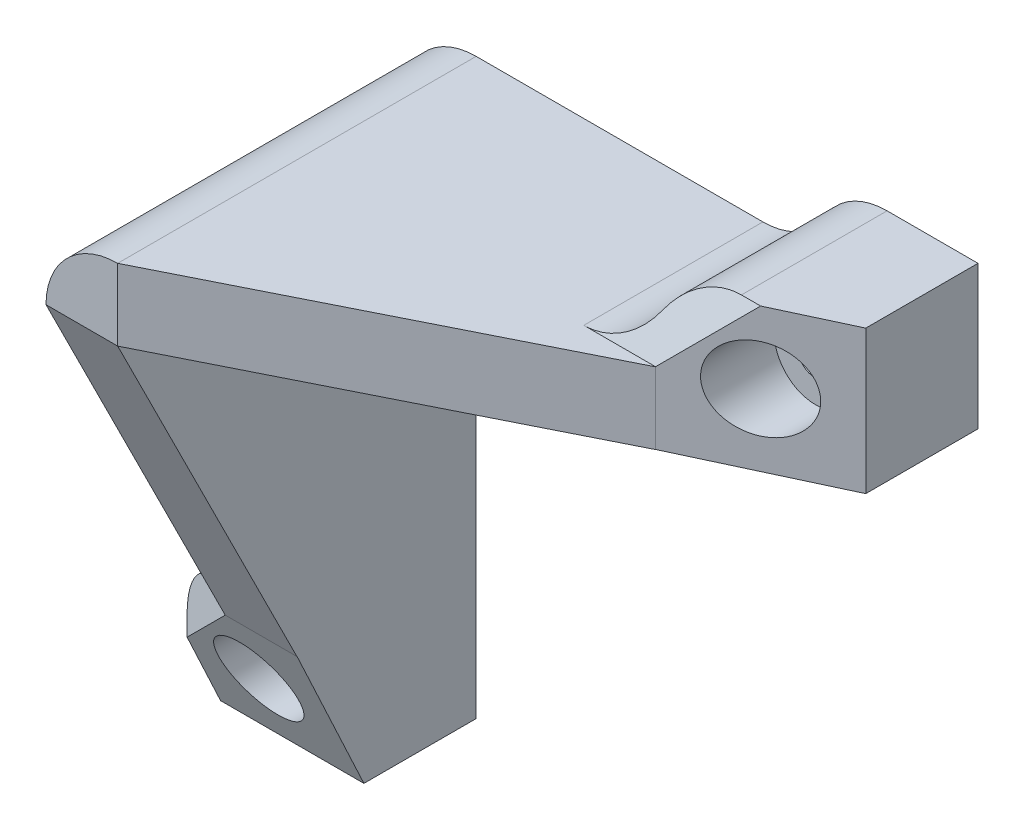
ISO-10303-21;
HEADER;
FILE_DESCRIPTION(('STEP AP214'),'2;1');
FILE_NAME('part.step','',(''),(''),'','','');
FILE_SCHEMA(('AUTOMOTIVE_DESIGN { 1 0 10303 214 1 1 1 1 }'));
ENDSEC;
DATA;
#1=APPLICATION_CONTEXT('core data for automotive mechanical design processes');
#2=APPLICATION_PROTOCOL_DEFINITION('international standard','automotive_design',2000,#1);
#3=PRODUCT_CONTEXT('',#1,'mechanical');
#4=PRODUCT('Part','Part','',(#3));
#5=PRODUCT_RELATED_PRODUCT_CATEGORY('part','',(#4));
#6=PRODUCT_DEFINITION_FORMATION('','',#4);
#7=PRODUCT_DEFINITION_CONTEXT('part definition',#1,'design');
#8=PRODUCT_DEFINITION('design','',#6,#7);
#9=PRODUCT_DEFINITION_SHAPE('','',#8);
#10=(LENGTH_UNIT() NAMED_UNIT(*) SI_UNIT(.MILLI.,.METRE.));
#11=(NAMED_UNIT(*) PLANE_ANGLE_UNIT() SI_UNIT($,.RADIAN.));
#12=(NAMED_UNIT(*) SI_UNIT($,.STERADIAN.) SOLID_ANGLE_UNIT());
#13=UNCERTAINTY_MEASURE_WITH_UNIT(LENGTH_MEASURE(1.E-05),#10,'distance_accuracy_value','');
#14=(GEOMETRIC_REPRESENTATION_CONTEXT(3) GLOBAL_UNCERTAINTY_ASSIGNED_CONTEXT((#13)) GLOBAL_UNIT_ASSIGNED_CONTEXT((#10,
#11,#12)) REPRESENTATION_CONTEXT('',''));
#15=CARTESIAN_POINT('',(0.,0.,0.));
#16=DIRECTION('',(0.,0.,1.));
#17=DIRECTION('',(1.,0.,0.));
#18=AXIS2_PLACEMENT_3D('',#15,#16,#17);
#19=CARTESIAN_POINT('',(57.3205080756888,10.,0.));
#20=DIRECTION('',(0.,0.,1.));
#21=DIRECTION('',(1.,0.,0.));
#22=AXIS2_PLACEMENT_3D('',#19,#20,#21);
#23=PLANE('',#22);
#24=CARTESIAN_POINT('',(60.,10.,0.));
#25=DIRECTION('',(0.,0.,-1.));
#26=DIRECTION('',(-1.,0.,0.));
#27=AXIS2_PLACEMENT_3D('',#24,#25,#26);
#28=CIRCLE('',#27,2.49999999999999);
#29=CARTESIAN_POINT('',(57.5,10.,0.));
#30=VERTEX_POINT('',#29);
#31=EDGE_CURVE('E773',#30,#30,#28,.T.);
#32=ORIENTED_EDGE('',*,*,#31,.F.);
#33=EDGE_LOOP('',(#32));
#34=FACE_BOUND('',#33,.T.);
#35=DIRECTION('',(0.,1.,0.));
#36=VECTOR('',#35,1.);
#37=CARTESIAN_POINT('',(-10.,9.99999999999999,0.));
#38=LINE('',#37,#36);
#39=CARTESIAN_POINT('',(-9.99999999999999,-40.,0.));
#40=VERTEX_POINT('',#39);
#41=CARTESIAN_POINT('',(-10.,0.,0.));
#42=VERTEX_POINT('',#41);
#43=EDGE_CURVE('E722',#40,#42,#38,.T.);
#44=ORIENTED_EDGE('',*,*,#43,.T.);
#45=CARTESIAN_POINT('',(0.,0.,0.));
#46=DIRECTION('',(0.,0.,1.));
#47=DIRECTION('',(1.,0.,0.));
#48=AXIS2_PLACEMENT_3D('',#45,#46,#47);
#49=CIRCLE('',#48,10.);
#50=CARTESIAN_POINT('',(0.,10.,0.));
#51=VERTEX_POINT('',#50);
#52=EDGE_CURVE('E305',#42,#51,#49,.F.);
#53=ORIENTED_EDGE('',*,*,#52,.T.);
#54=DIRECTION('',(1.,0.,0.));
#55=VECTOR('',#54,1.);
#56=CARTESIAN_POINT('',(40.,10.,0.));
#57=LINE('',#56,#55);
#58=CARTESIAN_POINT('',(40.,10.,0.));
#59=VERTEX_POINT('',#58);
#60=EDGE_CURVE('E721',#51,#59,#57,.T.);
#61=ORIENTED_EDGE('',*,*,#60,.T.);
#62=CARTESIAN_POINT('',(40.,20.,0.));
#63=DIRECTION('',(0.,0.,1.));
#64=DIRECTION('',(-1.,0.,0.));
#65=AXIS2_PLACEMENT_3D('',#62,#63,#64);
#66=CIRCLE('',#65,10.);
#67=CARTESIAN_POINT('',(48.6602540378444,15.,0.));
#68=VERTEX_POINT('',#67);
#69=EDGE_CURVE('E140',#59,#68,#66,.T.);
#70=ORIENTED_EDGE('',*,*,#69,.T.);
#71=CARTESIAN_POINT('',(57.3205080756888,10.,0.));
#72=DIRECTION('',(0.,0.,-1.));
#73=DIRECTION('',(1.,0.,0.));
#74=AXIS2_PLACEMENT_3D('',#71,#72,#73);
#75=CIRCLE('',#74,10.);
#76=CARTESIAN_POINT('',(57.3205080756888,20.,0.));
#77=VERTEX_POINT('',#76);
#78=EDGE_CURVE('E136',#68,#77,#75,.T.);
#79=ORIENTED_EDGE('',*,*,#78,.T.);
#80=DIRECTION('',(-1.,0.,0.));
#81=VECTOR('',#80,1.);
#82=CARTESIAN_POINT('',(70.,20.,0.));
#83=LINE('',#82,#81);
#84=CARTESIAN_POINT('',(70.,20.,0.));
#85=VERTEX_POINT('',#84);
#86=EDGE_CURVE('E736',#85,#77,#83,.T.);
#87=ORIENTED_EDGE('',*,*,#86,.F.);
#88=DIRECTION('',(0.,1.,0.));
#89=VECTOR('',#88,1.);
#90=CARTESIAN_POINT('',(70.,20.,0.));
#91=LINE('',#90,#89);
#92=CARTESIAN_POINT('',(70.,0.,0.));
#93=VERTEX_POINT('',#92);
#94=EDGE_CURVE('E744',#93,#85,#91,.T.);
#95=ORIENTED_EDGE('',*,*,#94,.F.);
#96=DIRECTION('',(1.,0.,0.));
#97=VECTOR('',#96,1.);
#98=CARTESIAN_POINT('',(0.,0.,0.));
#99=LINE('',#98,#97);
#100=CARTESIAN_POINT('',(0.,0.,0.));
#101=VERTEX_POINT('',#100);
#102=EDGE_CURVE('E747',#101,#93,#99,.T.);
#103=ORIENTED_EDGE('',*,*,#102,.F.);
#104=DIRECTION('',(0.,-1.,0.));
#105=VECTOR('',#104,1.);
#106=CARTESIAN_POINT('',(0.,-57.3205080756888,0.));
#107=LINE('',#106,#105);
#108=CARTESIAN_POINT('',(0.,-70.,0.));
#109=VERTEX_POINT('',#108);
#110=EDGE_CURVE('E733',#101,#109,#107,.T.);
#111=ORIENTED_EDGE('',*,*,#110,.T.);
#112=DIRECTION('',(1.,0.,0.));
#113=VECTOR('',#112,1.);
#114=CARTESIAN_POINT('',(0.,-70.,0.));
#115=LINE('',#114,#113);
#116=CARTESIAN_POINT('',(-20.,-70.,0.));
#117=VERTEX_POINT('',#116);
#118=EDGE_CURVE('E768',#117,#109,#115,.T.);
#119=ORIENTED_EDGE('',*,*,#118,.F.);
#120=DIRECTION('',(0.,1.,0.));
#121=VECTOR('',#120,1.);
#122=CARTESIAN_POINT('',(-20.,-70.,0.));
#123=LINE('',#122,#121);
#124=CARTESIAN_POINT('',(-20.,-57.3205080756888,0.));
#125=VERTEX_POINT('',#124);
#126=EDGE_CURVE('E765',#117,#125,#123,.T.);
#127=ORIENTED_EDGE('',*,*,#126,.T.);
#128=CARTESIAN_POINT('',(-10.,-57.3205080756888,0.));
#129=DIRECTION('',(0.,0.,-1.));
#130=DIRECTION('',(1.,0.,0.));
#131=AXIS2_PLACEMENT_3D('',#128,#129,#130);
#132=CIRCLE('',#131,10.);
#133=CARTESIAN_POINT('',(-15.,-48.6602540378444,0.));
#134=VERTEX_POINT('',#133);
#135=EDGE_CURVE('E731',#125,#134,#132,.T.);
#136=ORIENTED_EDGE('',*,*,#135,.T.);
#137=CARTESIAN_POINT('',(-20.,-40.,0.));
#138=DIRECTION('',(0.,0.,1.));
#139=DIRECTION('',(-1.,0.,0.));
#140=AXIS2_PLACEMENT_3D('',#137,#138,#139);
#141=CIRCLE('',#140,10.);
#142=EDGE_CURVE('E726',#134,#40,#141,.T.);
#143=ORIENTED_EDGE('',*,*,#142,.T.);
#144=EDGE_LOOP('',(#44,#53,#61,#70,#79,#87,#95,#103,#111,#119,#127,#136,#143));
#145=FACE_BOUND('',#144,.T.);
#146=CARTESIAN_POINT('',(-10.,-60.,0.));
#147=DIRECTION('',(0.,0.,-1.));
#148=DIRECTION('',(-1.,0.,0.));
#149=AXIS2_PLACEMENT_3D('',#146,#147,#148);
#150=CIRCLE('',#149,2.49999999999999);
#151=CARTESIAN_POINT('',(-12.5,-60.,0.));
#152=VERTEX_POINT('',#151);
#153=EDGE_CURVE('E157',#152,#152,#150,.T.);
#154=ORIENTED_EDGE('',*,*,#153,.F.);
#155=EDGE_LOOP('',(#154));
#156=FACE_BOUND('',#155,.T.);
#157=ADVANCED_FACE('F51',(#34,#145,#156),#23,.F.);
#158=CARTESIAN_POINT('',(0.,-57.3205080756888,0.));
#159=DIRECTION('',(-1.,0.,0.));
#160=DIRECTION('',(0.,0.,1.));
#161=AXIS2_PLACEMENT_3D('',#158,#159,#160);
#162=PLANE('',#161);
#163=DIRECTION('',(0.,0.,1.));
#164=VECTOR('',#163,1.);
#165=CARTESIAN_POINT('',(0.,-50.,5.));
#166=LINE('',#165,#164);
#167=CARTESIAN_POINT('',(0.,-50.,24.9812831519421));
#168=VERTEX_POINT('',#167);
#169=CARTESIAN_POINT('',(0.,-50.,25.));
#170=VERTEX_POINT('',#169);
#171=EDGE_CURVE('E757',#168,#170,#166,.T.);
#172=ORIENTED_EDGE('',*,*,#171,.F.);
#173=DIRECTION('',(0.,-0.906307787036647,-0.422618261740705));
#174=VECTOR('',#173,1.);
#175=CARTESIAN_POINT('',(0.,-65.5814065519395,17.7155539519461));
#176=LINE('',#175,#174);
#177=CARTESIAN_POINT('',(0.,-70.,15.655129988842));
#178=VERTEX_POINT('',#177);
#179=EDGE_CURVE('E143',#168,#178,#176,.T.);
#180=ORIENTED_EDGE('',*,*,#179,.T.);
#181=DIRECTION('',(0.,0.,1.));
#182=VECTOR('',#181,1.);
#183=CARTESIAN_POINT('',(0.,-70.,5.));
#184=LINE('',#183,#182);
#185=EDGE_CURVE('E770',#109,#178,#184,.T.);
#186=ORIENTED_EDGE('',*,*,#185,.F.);
#187=ORIENTED_EDGE('',*,*,#110,.F.);
#188=DIRECTION('',(0.,0.,-1.));
#189=VECTOR('',#188,1.);
#190=CARTESIAN_POINT('',(0.,0.,50.));
#191=LINE('',#190,#189);
#192=CARTESIAN_POINT('',(0.,0.,50.));
#193=VERTEX_POINT('',#192);
#194=EDGE_CURVE('E750',#193,#101,#191,.T.);
#195=ORIENTED_EDGE('',*,*,#194,.F.);
#196=DIRECTION('',(0.,-0.894427190999916,-0.447213595499958));
#197=VECTOR('',#196,1.);
#198=CARTESIAN_POINT('',(0.,0.,50.));
#199=LINE('',#198,#197);
#200=EDGE_CURVE('E710',#193,#170,#199,.T.);
#201=ORIENTED_EDGE('',*,*,#200,.T.);
#202=EDGE_LOOP('',(#172,#180,#186,#187,#195,#201));
#203=FACE_BOUND('',#202,.T.);
#204=ADVANCED_FACE('F193',(#203),#162,.F.);
#205=CARTESIAN_POINT('',(-10.,-57.3205080756888,0.));
#206=DIRECTION('',(0.,0.,1.));
#207=DIRECTION('',(1.,0.,0.));
#208=AXIS2_PLACEMENT_3D('',#205,#206,#207);
#209=CYLINDRICAL_SURFACE('',#208,10.);
#210=DIRECTION('',(0.,0.,1.));
#211=VECTOR('',#210,1.);
#212=CARTESIAN_POINT('',(-20.,-57.3205080756888,0.));
#213=LINE('',#212,#211);
#214=CARTESIAN_POINT('',(-20.,-57.3205080756888,20.318206570392));
#215=VERTEX_POINT('',#214);
#216=EDGE_CURVE('E715',#125,#215,#213,.T.);
#217=ORIENTED_EDGE('',*,*,#216,.T.);
#218=CARTESIAN_POINT('',(-10.,-57.3205080756888,24.9812831519421));
#219=DIRECTION('',(0.422618261740705,0.,-0.906307787036647));
#220=DIRECTION('',(0.906307787036647,0.,0.422618261740705));
#221=AXIS2_PLACEMENT_3D('',#218,#219,#220);
#222=ELLIPSE('',#221,11.033779189625,10.);
#223=CARTESIAN_POINT('',(-15.,-48.6602540378444,22.6497448611671));
#224=VERTEX_POINT('',#223);
#225=EDGE_CURVE('E286',#215,#224,#222,.T.);
#226=ORIENTED_EDGE('',*,*,#225,.T.);
#227=DIRECTION('',(0.,0.,1.));
#228=VECTOR('',#227,1.);
#229=CARTESIAN_POINT('',(-15.,-48.6602540378444,0.));
#230=LINE('',#229,#228);
#231=EDGE_CURVE('E713',#134,#224,#230,.T.);
#232=ORIENTED_EDGE('',*,*,#231,.F.);
#233=ORIENTED_EDGE('',*,*,#135,.F.);
#234=EDGE_LOOP('',(#217,#226,#232,#233));
#235=FACE_BOUND('',#234,.T.);
#236=ADVANCED_FACE('F204',(#235),#209,.T.);
#237=CARTESIAN_POINT('',(-20.,-40.,0.));
#238=DIRECTION('',(0.,0.,1.));
#239=DIRECTION('',(1.,0.,0.));
#240=AXIS2_PLACEMENT_3D('',#237,#238,#239);
#241=CYLINDRICAL_SURFACE('',#240,10.);
#242=ORIENTED_EDGE('',*,*,#231,.T.);
#243=CARTESIAN_POINT('',(-20.,-40.,20.318206570392));
#244=DIRECTION('',(0.422618261740705,0.,-0.906307787036647));
#245=DIRECTION('',(0.906307787036647,0.,0.422618261740705));
#246=AXIS2_PLACEMENT_3D('',#243,#244,#245);
#247=ELLIPSE('',#246,11.033779189625,10.);
#248=CARTESIAN_POINT('',(-10.,-40.,24.9812831519421));
#249=VERTEX_POINT('',#248);
#250=EDGE_CURVE('E291',#224,#249,#247,.F.);
#251=ORIENTED_EDGE('',*,*,#250,.T.);
#252=DIRECTION('',(0.,0.,1.));
#253=VECTOR('',#252,1.);
#254=CARTESIAN_POINT('',(-9.99999999999999,-40.,0.));
#255=LINE('',#254,#253);
#256=EDGE_CURVE('E718',#40,#249,#255,.T.);
#257=ORIENTED_EDGE('',*,*,#256,.F.);
#258=ORIENTED_EDGE('',*,*,#142,.F.);
#259=EDGE_LOOP('',(#242,#251,#257,#258));
#260=FACE_BOUND('',#259,.T.);
#261=ADVANCED_FACE('F212',(#260),#241,.F.);
#262=CARTESIAN_POINT('',(70.,0.,0.));
#263=DIRECTION('',(-1.,0.,0.));
#264=DIRECTION('',(0.,0.,1.));
#265=AXIS2_PLACEMENT_3D('',#262,#263,#264);
#266=PLANE('',#265);
#267=DIRECTION('',(0.,0.,1.));
#268=VECTOR('',#267,1.);
#269=CARTESIAN_POINT('',(70.,0.,0.));
#270=LINE('',#269,#268);
#271=CARTESIAN_POINT('',(70.,0.,15.655129988842));
#272=VERTEX_POINT('',#271);
#273=EDGE_CURVE('E80',#93,#272,#270,.T.);
#274=ORIENTED_EDGE('',*,*,#273,.F.);
#275=ORIENTED_EDGE('',*,*,#94,.T.);
#276=DIRECTION('',(0.,0.,1.));
#277=VECTOR('',#276,1.);
#278=CARTESIAN_POINT('',(70.,20.,25.));
#279=LINE('',#278,#277);
#280=CARTESIAN_POINT('',(70.,20.,15.655129988842));
#281=VERTEX_POINT('',#280);
#282=EDGE_CURVE('E67',#85,#281,#279,.T.);
#283=ORIENTED_EDGE('',*,*,#282,.T.);
#284=DIRECTION('',(0.,-1.,0.));
#285=VECTOR('',#284,1.);
#286=CARTESIAN_POINT('',(70.,0.,15.655129988842));
#287=LINE('',#286,#285);
#288=EDGE_CURVE('E153',#281,#272,#287,.T.);
#289=ORIENTED_EDGE('',*,*,#288,.T.);
#290=EDGE_LOOP('',(#274,#275,#283,#289));
#291=FACE_BOUND('',#290,.T.);
#292=ADVANCED_FACE('F218',(#291),#266,.F.);
#293=CARTESIAN_POINT('',(25.,17.,37.5));
#294=DIRECTION('',(-0.447213595499958,0.,-0.894427190999916));
#295=DIRECTION('',(-0.894427190999916,0.,0.447213595499958));
#296=AXIS2_PLACEMENT_3D('',#293,#294,#295);
#297=PLANE('',#296);
#298=DIRECTION('',(-0.894427190999916,0.,0.447213595499958));
#299=VECTOR('',#298,1.);
#300=CARTESIAN_POINT('',(50.,0.,25.));
#301=LINE('',#300,#299);
#302=CARTESIAN_POINT('',(50.,0.,25.));
#303=VERTEX_POINT('',#302);
#304=EDGE_CURVE('E755',#303,#193,#301,.T.);
#305=ORIENTED_EDGE('',*,*,#304,.F.);
#306=DIRECTION('',(0.,-1.,0.));
#307=VECTOR('',#306,1.);
#308=CARTESIAN_POINT('',(50.,5.,25.));
#309=LINE('',#308,#307);
#310=CARTESIAN_POINT('',(50.,10.,25.));
#311=VERTEX_POINT('',#310);
#312=EDGE_CURVE('E321',#303,#311,#309,.F.);
#313=ORIENTED_EDGE('',*,*,#312,.T.);
#314=DIRECTION('',(0.894427190999916,0.,-0.447213595499958));
#315=VECTOR('',#314,1.);
#316=CARTESIAN_POINT('',(50.,10.,25.));
#317=LINE('',#316,#315);
#318=CARTESIAN_POINT('',(0.,10.,50.));
#319=VERTEX_POINT('',#318);
#320=EDGE_CURVE('E703',#319,#311,#317,.T.);
#321=ORIENTED_EDGE('',*,*,#320,.F.);
#322=DIRECTION('',(0.,-1.,0.));
#323=VECTOR('',#322,1.);
#324=CARTESIAN_POINT('',(0.,10.,50.));
#325=LINE('',#324,#323);
#326=EDGE_CURVE('E516',#319,#193,#325,.T.);
#327=ORIENTED_EDGE('',*,*,#326,.T.);
#328=EDGE_LOOP('',(#305,#313,#321,#327));
#329=FACE_BOUND('',#328,.T.);
#330=ADVANCED_FACE('F231',(#329),#297,.F.);
#331=CARTESIAN_POINT('',(70.,20.,25.));
#332=DIRECTION('',(0.,-1.,0.));
#333=DIRECTION('',(0.,0.,-1.));
#334=AXIS2_PLACEMENT_3D('',#331,#332,#333);
#335=PLANE('',#334);
#336=DIRECTION('',(1.,0.,0.));
#337=VECTOR('',#336,1.);
#338=CARTESIAN_POINT('',(70.,20.,20.318206570392));
#339=LINE('',#338,#337);
#340=CARTESIAN_POINT('',(57.3205080756888,20.,20.318206570392));
#341=VERTEX_POINT('',#340);
#342=CARTESIAN_POINT('',(60.,20.,20.318206570392));
#343=VERTEX_POINT('',#342);
#344=EDGE_CURVE('E148',#341,#343,#339,.T.);
#345=ORIENTED_EDGE('',*,*,#344,.T.);
#346=DIRECTION('',(0.906307787036647,0.,-0.422618261740705));
#347=VECTOR('',#346,1.);
#348=CARTESIAN_POINT('',(66.4207071281416,20.,17.3241816657692));
#349=LINE('',#348,#347);
#350=EDGE_CURVE('E13',#343,#281,#349,.T.);
#351=ORIENTED_EDGE('',*,*,#350,.T.);
#352=ORIENTED_EDGE('',*,*,#282,.F.);
#353=ORIENTED_EDGE('',*,*,#86,.T.);
#354=DIRECTION('',(0.,0.,1.));
#355=VECTOR('',#354,1.);
#356=CARTESIAN_POINT('',(57.3205080756888,20.,0.));
#357=LINE('',#356,#355);
#358=EDGE_CURVE('E708',#77,#341,#357,.T.);
#359=ORIENTED_EDGE('',*,*,#358,.T.);
#360=EDGE_LOOP('',(#345,#351,#352,#353,#359));
#361=FACE_BOUND('',#360,.T.);
#362=ADVANCED_FACE('F206',(#361),#335,.F.);
#363=CARTESIAN_POINT('',(57.3205080756888,10.,0.));
#364=DIRECTION('',(0.,0.,1.));
#365=DIRECTION('',(1.,0.,0.));
#366=AXIS2_PLACEMENT_3D('',#363,#364,#365);
#367=CYLINDRICAL_SURFACE('',#366,10.);
#368=DIRECTION('',(0.,0.,1.));
#369=VECTOR('',#368,1.);
#370=CARTESIAN_POINT('',(48.6602540378444,15.,0.));
#371=LINE('',#370,#369);
#372=CARTESIAN_POINT('',(48.6602540378444,15.,22.6497448611671));
#373=VERTEX_POINT('',#372);
#374=EDGE_CURVE('E128',#68,#373,#371,.T.);
#375=ORIENTED_EDGE('',*,*,#374,.T.);
#376=CARTESIAN_POINT('',(57.3205080756888,10.,24.9812831519421));
#377=DIRECTION('',(0.,-0.422618261740705,-0.906307787036647));
#378=DIRECTION('',(0.,-0.906307787036647,0.422618261740705));
#379=AXIS2_PLACEMENT_3D('',#376,#377,#378);
#380=ELLIPSE('',#379,11.033779189625,10.);
#381=EDGE_CURVE('E131',#373,#341,#380,.T.);
#382=ORIENTED_EDGE('',*,*,#381,.T.);
#383=ORIENTED_EDGE('',*,*,#358,.F.);
#384=ORIENTED_EDGE('',*,*,#78,.F.);
#385=EDGE_LOOP('',(#375,#382,#383,#384));
#386=FACE_BOUND('',#385,.T.);
#387=ADVANCED_FACE('F129',(#386),#367,.T.);
#388=CARTESIAN_POINT('',(40.,20.,0.));
#389=DIRECTION('',(0.,0.,1.));
#390=DIRECTION('',(1.,0.,0.));
#391=AXIS2_PLACEMENT_3D('',#388,#389,#390);
#392=CYLINDRICAL_SURFACE('',#391,10.);
#393=DIRECTION('',(0.,0.,1.));
#394=VECTOR('',#393,1.);
#395=CARTESIAN_POINT('',(40.,10.,0.));
#396=LINE('',#395,#394);
#397=CARTESIAN_POINT('',(40.,10.,24.9812831519421));
#398=VERTEX_POINT('',#397);
#399=EDGE_CURVE('E100',#59,#398,#396,.T.);
#400=ORIENTED_EDGE('',*,*,#399,.T.);
#401=CARTESIAN_POINT('',(40.,20.,20.318206570392));
#402=DIRECTION('',(0.,-0.422618261740705,-0.906307787036647));
#403=DIRECTION('',(0.,-0.906307787036647,0.422618261740705));
#404=AXIS2_PLACEMENT_3D('',#401,#402,#403);
#405=ELLIPSE('',#404,11.033779189625,10.);
#406=EDGE_CURVE('E137',#398,#373,#405,.F.);
#407=ORIENTED_EDGE('',*,*,#406,.T.);
#408=ORIENTED_EDGE('',*,*,#374,.F.);
#409=ORIENTED_EDGE('',*,*,#69,.F.);
#410=EDGE_LOOP('',(#400,#407,#408,#409));
#411=FACE_BOUND('',#410,.T.);
#412=ADVANCED_FACE('F142',(#411),#392,.F.);
#413=CARTESIAN_POINT('',(-39.7,-25.,37.5));
#414=DIRECTION('',(0.,0.447213595499958,-0.894427190999916));
#415=DIRECTION('',(0.,0.894427190999916,0.447213595499958));
#416=AXIS2_PLACEMENT_3D('',#413,#414,#415);
#417=PLANE('',#416);
#418=ORIENTED_EDGE('',*,*,#200,.F.);
#419=DIRECTION('',(1.,0.,0.));
#420=VECTOR('',#419,1.);
#421=CARTESIAN_POINT('',(-39.7,0.,50.));
#422=LINE('',#421,#420);
#423=CARTESIAN_POINT('',(-10.,0.,50.));
#424=VERTEX_POINT('',#423);
#425=EDGE_CURVE('E320',#424,#193,#422,.T.);
#426=ORIENTED_EDGE('',*,*,#425,.F.);
#427=DIRECTION('',(0.,0.894427190999916,0.447213595499958));
#428=VECTOR('',#427,1.);
#429=CARTESIAN_POINT('',(-10.,-20.,40.));
#430=LINE('',#429,#428);
#431=CARTESIAN_POINT('',(-10.,-50.,25.));
#432=VERTEX_POINT('',#431);
#433=EDGE_CURVE('E512',#432,#424,#430,.T.);
#434=ORIENTED_EDGE('',*,*,#433,.F.);
#435=DIRECTION('',(1.,0.,0.));
#436=VECTOR('',#435,1.);
#437=CARTESIAN_POINT('',(-39.7,-50.,25.));
#438=LINE('',#437,#436);
#439=EDGE_CURVE('E313',#170,#432,#438,.F.);
#440=ORIENTED_EDGE('',*,*,#439,.F.);
#441=EDGE_LOOP('',(#418,#426,#434,#440));
#442=FACE_BOUND('',#441,.T.);
#443=ADVANCED_FACE('F215',(#442),#417,.F.);
#444=CARTESIAN_POINT('',(-10.,-25.,50.));
#445=DIRECTION('',(1.,0.,0.));
#446=DIRECTION('',(0.,1.,0.));
#447=AXIS2_PLACEMENT_3D('',#444,#445,#446);
#448=PLANE('',#447);
#449=ORIENTED_EDGE('',*,*,#256,.T.);
#450=DIRECTION('',(0.,-1.,0.));
#451=VECTOR('',#450,1.);
#452=CARTESIAN_POINT('',(-10.,-25.,24.9812831519421));
#453=LINE('',#452,#451);
#454=CARTESIAN_POINT('',(-10.,-50.,24.9812831519421));
#455=VERTEX_POINT('',#454);
#456=EDGE_CURVE('E297',#249,#455,#453,.T.);
#457=ORIENTED_EDGE('',*,*,#456,.T.);
#458=DIRECTION('',(0.,0.,1.));
#459=VECTOR('',#458,1.);
#460=CARTESIAN_POINT('',(-10.,-50.,5.));
#461=LINE('',#460,#459);
#462=EDGE_CURVE('E758',#455,#432,#461,.T.);
#463=ORIENTED_EDGE('',*,*,#462,.T.);
#464=ORIENTED_EDGE('',*,*,#433,.T.);
#465=DIRECTION('',(0.,0.,1.));
#466=VECTOR('',#465,1.);
#467=CARTESIAN_POINT('',(-10.,0.,50.));
#468=LINE('',#467,#466);
#469=EDGE_CURVE('E304',#424,#42,#468,.F.);
#470=ORIENTED_EDGE('',*,*,#469,.T.);
#471=ORIENTED_EDGE('',*,*,#43,.F.);
#472=EDGE_LOOP('',(#449,#457,#463,#464,#470,#471));
#473=FACE_BOUND('',#472,.T.);
#474=ADVANCED_FACE('F233',(#473),#448,.F.);
#475=CARTESIAN_POINT('',(0.,10.,50.));
#476=DIRECTION('',(0.,0.,-1.));
#477=DIRECTION('',(-1.,0.,0.));
#478=AXIS2_PLACEMENT_3D('',#475,#476,#477);
#479=PLANE('',#478);
#480=ORIENTED_EDGE('',*,*,#326,.F.);
#481=CARTESIAN_POINT('',(0.,0.,50.));
#482=DIRECTION('',(0.,0.,-1.));
#483=DIRECTION('',(-1.,0.,0.));
#484=AXIS2_PLACEMENT_3D('',#481,#482,#483);
#485=CIRCLE('',#484,10.);
#486=EDGE_CURVE('E308',#319,#424,#485,.F.);
#487=ORIENTED_EDGE('',*,*,#486,.T.);
#488=ORIENTED_EDGE('',*,*,#425,.T.);
#489=EDGE_LOOP('',(#480,#487,#488));
#490=FACE_BOUND('',#489,.T.);
#491=ADVANCED_FACE('F227',(#490),#479,.F.);
#492=CARTESIAN_POINT('',(0.,10.,0.));
#493=DIRECTION('',(0.,-1.,0.));
#494=DIRECTION('',(1.,0.,0.));
#495=AXIS2_PLACEMENT_3D('',#492,#493,#494);
#496=PLANE('',#495);
#497=DIRECTION('',(0.,0.,1.));
#498=VECTOR('',#497,1.);
#499=CARTESIAN_POINT('',(50.,10.,5.));
#500=LINE('',#499,#498);
#501=CARTESIAN_POINT('',(50.,10.,24.9812831519421));
#502=VERTEX_POINT('',#501);
#503=EDGE_CURVE('E743',#502,#311,#500,.T.);
#504=ORIENTED_EDGE('',*,*,#503,.F.);
#505=DIRECTION('',(-1.,0.,0.));
#506=VECTOR('',#505,1.);
#507=CARTESIAN_POINT('',(0.,10.,24.9812831519421));
#508=LINE('',#507,#506);
#509=EDGE_CURVE('E300',#502,#398,#508,.T.);
#510=ORIENTED_EDGE('',*,*,#509,.T.);
#511=ORIENTED_EDGE('',*,*,#399,.F.);
#512=ORIENTED_EDGE('',*,*,#60,.F.);
#513=DIRECTION('',(0.,0.,1.));
#514=VECTOR('',#513,1.);
#515=CARTESIAN_POINT('',(0.,10.,0.));
#516=LINE('',#515,#514);
#517=EDGE_CURVE('E311',#51,#319,#516,.T.);
#518=ORIENTED_EDGE('',*,*,#517,.T.);
#519=ORIENTED_EDGE('',*,*,#320,.T.);
#520=EDGE_LOOP('',(#504,#510,#511,#512,#518,#519));
#521=FACE_BOUND('',#520,.T.);
#522=ADVANCED_FACE('F225',(#521),#496,.F.);
#523=CARTESIAN_POINT('',(50.,10.,5.));
#524=DIRECTION('',(-1.,0.,0.));
#525=DIRECTION('',(0.,0.,1.));
#526=AXIS2_PLACEMENT_3D('',#523,#524,#525);
#527=PLANE('',#526);
#528=DIRECTION('',(0.,0.,1.));
#529=VECTOR('',#528,1.);
#530=CARTESIAN_POINT('',(50.,0.,5.));
#531=LINE('',#530,#529);
#532=CARTESIAN_POINT('',(50.,0.,24.9812831519421));
#533=VERTEX_POINT('',#532);
#534=EDGE_CURVE('E752',#533,#303,#531,.T.);
#535=ORIENTED_EDGE('',*,*,#534,.F.);
#536=DIRECTION('',(0.,1.,0.));
#537=VECTOR('',#536,1.);
#538=CARTESIAN_POINT('',(50.,10.,24.9812831519421));
#539=LINE('',#538,#537);
#540=EDGE_CURVE('E109',#533,#502,#539,.T.);
#541=ORIENTED_EDGE('',*,*,#540,.T.);
#542=ORIENTED_EDGE('',*,*,#503,.T.);
#543=ORIENTED_EDGE('',*,*,#312,.F.);
#544=EDGE_LOOP('',(#535,#541,#542,#543));
#545=FACE_BOUND('',#544,.T.);
#546=ADVANCED_FACE('F228',(#545),#527,.F.);
#547=CARTESIAN_POINT('',(0.,0.,0.));
#548=DIRECTION('',(0.,1.,0.));
#549=DIRECTION('',(0.,0.,1.));
#550=AXIS2_PLACEMENT_3D('',#547,#548,#549);
#551=PLANE('',#550);
#552=ORIENTED_EDGE('',*,*,#273,.T.);
#553=DIRECTION('',(-0.906307787036647,0.,0.422618261740705));
#554=VECTOR('',#553,1.);
#555=CARTESIAN_POINT('',(18.4986963281004,0.,39.6705822960153));
#556=LINE('',#555,#554);
#557=EDGE_CURVE('E61',#272,#533,#556,.T.);
#558=ORIENTED_EDGE('',*,*,#557,.T.);
#559=ORIENTED_EDGE('',*,*,#534,.T.);
#560=ORIENTED_EDGE('',*,*,#304,.T.);
#561=ORIENTED_EDGE('',*,*,#194,.T.);
#562=ORIENTED_EDGE('',*,*,#102,.T.);
#563=EDGE_LOOP('',(#552,#558,#559,#560,#561,#562));
#564=FACE_BOUND('',#563,.T.);
#565=ADVANCED_FACE('F871',(#564),#551,.F.);
#566=CARTESIAN_POINT('',(0.,-50.,5.));
#567=DIRECTION('',(0.,1.,0.));
#568=DIRECTION('',(0.,0.,1.));
#569=AXIS2_PLACEMENT_3D('',#566,#567,#568);
#570=PLANE('',#569);
#571=ORIENTED_EDGE('',*,*,#462,.F.);
#572=DIRECTION('',(1.,0.,0.));
#573=VECTOR('',#572,1.);
#574=CARTESIAN_POINT('',(0.,-50.,24.9812831519421));
#575=LINE('',#574,#573);
#576=EDGE_CURVE('E276',#455,#168,#575,.T.);
#577=ORIENTED_EDGE('',*,*,#576,.T.);
#578=ORIENTED_EDGE('',*,*,#171,.T.);
#579=ORIENTED_EDGE('',*,*,#439,.T.);
#580=EDGE_LOOP('',(#571,#577,#578,#579));
#581=FACE_BOUND('',#580,.T.);
#582=ADVANCED_FACE('F874',(#581),#570,.F.);
#583=CARTESIAN_POINT('',(-20.,-70.,0.));
#584=DIRECTION('',(1.,0.,0.));
#585=DIRECTION('',(0.,0.,-1.));
#586=AXIS2_PLACEMENT_3D('',#583,#584,#585);
#587=PLANE('',#586);
#588=ORIENTED_EDGE('',*,*,#216,.F.);
#589=ORIENTED_EDGE('',*,*,#126,.F.);
#590=DIRECTION('',(0.,0.,-1.));
#591=VECTOR('',#590,1.);
#592=CARTESIAN_POINT('',(-20.,-70.,0.));
#593=LINE('',#592,#591);
#594=CARTESIAN_POINT('',(-20.,-70.,15.655129988842));
#595=VERTEX_POINT('',#594);
#596=EDGE_CURVE('E775',#595,#117,#593,.T.);
#597=ORIENTED_EDGE('',*,*,#596,.F.);
#598=DIRECTION('',(0.,0.906307787036647,0.422618261740705));
#599=VECTOR('',#598,1.);
#600=CARTESIAN_POINT('',(-20.,-75.9962626671289,12.8590267868508));
#601=LINE('',#600,#599);
#602=CARTESIAN_POINT('',(-20.,-60.,20.318206570392));
#603=VERTEX_POINT('',#602);
#604=EDGE_CURVE('E281',#595,#603,#601,.T.);
#605=ORIENTED_EDGE('',*,*,#604,.T.);
#606=DIRECTION('',(0.,1.,0.));
#607=VECTOR('',#606,1.);
#608=CARTESIAN_POINT('',(-20.,-70.,20.318206570392));
#609=LINE('',#608,#607);
#610=EDGE_CURVE('E287',#603,#215,#609,.T.);
#611=ORIENTED_EDGE('',*,*,#610,.T.);
#612=EDGE_LOOP('',(#588,#589,#597,#605,#611));
#613=FACE_BOUND('',#612,.T.);
#614=ADVANCED_FACE('F840',(#613),#587,.F.);
#615=CARTESIAN_POINT('',(0.,-70.,0.));
#616=DIRECTION('',(0.,1.,0.));
#617=DIRECTION('',(0.,0.,1.));
#618=AXIS2_PLACEMENT_3D('',#615,#616,#617);
#619=PLANE('',#618);
#620=ORIENTED_EDGE('',*,*,#596,.T.);
#621=ORIENTED_EDGE('',*,*,#118,.T.);
#622=ORIENTED_EDGE('',*,*,#185,.T.);
#623=DIRECTION('',(-1.,0.,0.));
#624=VECTOR('',#623,1.);
#625=CARTESIAN_POINT('',(0.,-70.,15.655129988842));
#626=LINE('',#625,#624);
#627=EDGE_CURVE('E279',#178,#595,#626,.T.);
#628=ORIENTED_EDGE('',*,*,#627,.T.);
#629=EDGE_LOOP('',(#620,#621,#622,#628));
#630=FACE_BOUND('',#629,.T.);
#631=ADVANCED_FACE('F841',(#630),#619,.F.);
#632=CARTESIAN_POINT('',(60.,10.,0.));
#633=DIRECTION('',(0.,0.,-1.));
#634=DIRECTION('',(-1.,0.,0.));
#635=AXIS2_PLACEMENT_3D('',#632,#633,#634);
#636=CYLINDRICAL_SURFACE('',#635,2.5);
#637=CARTESIAN_POINT('',(60.,10.,12.7));
#638=DIRECTION('',(0.,0.,-1.));
#639=DIRECTION('',(-1.,0.,0.));
#640=AXIS2_PLACEMENT_3D('',#637,#638,#639);
#641=CIRCLE('',#640,2.5);
#642=CARTESIAN_POINT('',(57.5,10.,12.7));
#643=VERTEX_POINT('',#642);
#644=EDGE_CURVE('E57',#643,#643,#641,.F.);
#645=ORIENTED_EDGE('',*,*,#644,.T.);
#646=EDGE_LOOP('',(#645));
#647=FACE_BOUND('',#646,.T.);
#648=ORIENTED_EDGE('',*,*,#31,.T.);
#649=EDGE_LOOP('',(#648));
#650=FACE_BOUND('',#649,.T.);
#651=ADVANCED_FACE('F176',(#647,#650),#636,.F.);
#652=CARTESIAN_POINT('',(-10.,-60.,0.));
#653=DIRECTION('',(0.,0.,-1.));
#654=DIRECTION('',(-1.,0.,0.));
#655=AXIS2_PLACEMENT_3D('',#652,#653,#654);
#656=CYLINDRICAL_SURFACE('',#655,2.49999999999999);
#657=CARTESIAN_POINT('',(-10.,-60.,12.7));
#658=DIRECTION('',(0.,0.,-1.));
#659=DIRECTION('',(-1.,0.,0.));
#660=AXIS2_PLACEMENT_3D('',#657,#658,#659);
#661=CIRCLE('',#660,2.49999999999999);
#662=CARTESIAN_POINT('',(-12.5,-60.,12.7));
#663=VERTEX_POINT('',#662);
#664=EDGE_CURVE('E169',#663,#663,#661,.F.);
#665=ORIENTED_EDGE('',*,*,#664,.T.);
#666=EDGE_LOOP('',(#665));
#667=FACE_BOUND('',#666,.T.);
#668=ORIENTED_EDGE('',*,*,#153,.T.);
#669=EDGE_LOOP('',(#668));
#670=FACE_BOUND('',#669,.T.);
#671=ADVANCED_FACE('F246',(#667,#670),#656,.F.);
#672=CARTESIAN_POINT('',(0.,0.,0.));
#673=DIRECTION('',(0.,0.,1.));
#674=DIRECTION('',(0.,-1.,0.));
#675=AXIS2_PLACEMENT_3D('',#672,#673,#674);
#676=CYLINDRICAL_SURFACE('',#675,10.);
#677=ORIENTED_EDGE('',*,*,#52,.F.);
#678=ORIENTED_EDGE('',*,*,#469,.F.);
#679=ORIENTED_EDGE('',*,*,#486,.F.);
#680=ORIENTED_EDGE('',*,*,#517,.F.);
#681=EDGE_LOOP('',(#677,#678,#679,#680));
#682=FACE_BOUND('',#681,.T.);
#683=ADVANCED_FACE('F245',(#682),#676,.T.);
#684=CARTESIAN_POINT('',(-10.,-92.8500000000002,5.));
#685=DIRECTION('',(0.,0.422618261740705,-0.906307787036647));
#686=DIRECTION('',(-1.,0.,0.));
#687=AXIS2_PLACEMENT_3D('',#684,#685,#686);
#688=PLANE('',#687);
#689=CARTESIAN_POINT('',(-10.,-60.,20.318206570392));
#690=DIRECTION('',(0.,0.422618261740705,-0.906307787036647));
#691=DIRECTION('',(0.,-0.906307787036647,-0.422618261740705));
#692=AXIS2_PLACEMENT_3D('',#689,#690,#691);
#693=ELLIPSE('',#692,6.30580480687066,5.715);
#694=CARTESIAN_POINT('',(-10.,-65.715,17.6532583040362));
#695=VERTEX_POINT('',#694);
#696=EDGE_CURVE('E168',#695,#695,#693,.T.);
#697=ORIENTED_EDGE('',*,*,#696,.T.);
#698=EDGE_LOOP('',(#697));
#699=FACE_BOUND('',#698,.T.);
#700=ORIENTED_EDGE('',*,*,#179,.F.);
#701=ORIENTED_EDGE('',*,*,#576,.F.);
#702=DIRECTION('',(0.671542934237817,0.671542934237817,0.313145613014978));
#703=VECTOR('',#702,1.);
#704=CARTESIAN_POINT('',(-36.8272681348451,-76.8272681348451,12.471522573286));
#705=LINE('',#704,#703);
#706=EDGE_CURVE('E156',#603,#455,#705,.T.);
#707=ORIENTED_EDGE('',*,*,#706,.F.);
#708=ORIENTED_EDGE('',*,*,#604,.F.);
#709=ORIENTED_EDGE('',*,*,#627,.F.);
#710=EDGE_LOOP('',(#700,#701,#707,#708,#709));
#711=FACE_BOUND('',#710,.T.);
#712=ADVANCED_FACE('F244',(#699,#711),#688,.F.);
#713=CARTESIAN_POINT('',(-52.8500000000001,-57.3205080756888,5.));
#714=DIRECTION('',(0.422618261740705,0.,-0.906307787036647));
#715=DIRECTION('',(0.,1.,0.));
#716=AXIS2_PLACEMENT_3D('',#713,#714,#715);
#717=PLANE('',#716);
#718=ORIENTED_EDGE('',*,*,#706,.T.);
#719=ORIENTED_EDGE('',*,*,#456,.F.);
#720=ORIENTED_EDGE('',*,*,#250,.F.);
#721=ORIENTED_EDGE('',*,*,#225,.F.);
#722=ORIENTED_EDGE('',*,*,#610,.F.);
#723=EDGE_LOOP('',(#718,#719,#720,#721,#722));
#724=FACE_BOUND('',#723,.T.);
#725=ADVANCED_FACE('F248',(#724),#717,.F.);
#726=CARTESIAN_POINT('',(92.8500000000002,10.,5.));
#727=DIRECTION('',(-0.422618261740705,0.,-0.906307787036647));
#728=DIRECTION('',(0.,-1.,0.));
#729=AXIS2_PLACEMENT_3D('',#726,#727,#728);
#730=PLANE('',#729);
#731=CARTESIAN_POINT('',(60.,10.,20.318206570392));
#732=DIRECTION('',(-0.422618261740705,0.,-0.906307787036647));
#733=DIRECTION('',(0.906307787036647,0.,-0.422618261740705));
#734=AXIS2_PLACEMENT_3D('',#731,#732,#733);
#735=ELLIPSE('',#734,6.30580480687066,5.715);
#736=CARTESIAN_POINT('',(65.715,10.,17.6532583040362));
#737=VERTEX_POINT('',#736);
#738=EDGE_CURVE('E161',#737,#737,#735,.T.);
#739=ORIENTED_EDGE('',*,*,#738,.T.);
#740=EDGE_LOOP('',(#739));
#741=FACE_BOUND('',#740,.T.);
#742=ORIENTED_EDGE('',*,*,#288,.F.);
#743=ORIENTED_EDGE('',*,*,#350,.F.);
#744=DIRECTION('',(0.671542934237817,0.671542934237817,-0.313145613014978));
#745=VECTOR('',#744,1.);
#746=CARTESIAN_POINT('',(76.8272681348451,36.8272681348451,12.471522573286));
#747=LINE('',#746,#745);
#748=EDGE_CURVE('E163',#502,#343,#747,.T.);
#749=ORIENTED_EDGE('',*,*,#748,.F.);
#750=ORIENTED_EDGE('',*,*,#540,.F.);
#751=ORIENTED_EDGE('',*,*,#557,.F.);
#752=EDGE_LOOP('',(#742,#743,#749,#750,#751));
#753=FACE_BOUND('',#752,.T.);
#754=ADVANCED_FACE('F53',(#741,#753),#730,.F.);
#755=CARTESIAN_POINT('',(57.3205080756888,52.8500000000002,5.));
#756=DIRECTION('',(0.,-0.422618261740705,-0.906307787036647));
#757=DIRECTION('',(1.,0.,0.));
#758=AXIS2_PLACEMENT_3D('',#755,#756,#757);
#759=PLANE('',#758);
#760=ORIENTED_EDGE('',*,*,#406,.F.);
#761=ORIENTED_EDGE('',*,*,#509,.F.);
#762=ORIENTED_EDGE('',*,*,#748,.T.);
#763=ORIENTED_EDGE('',*,*,#344,.F.);
#764=ORIENTED_EDGE('',*,*,#381,.F.);
#765=EDGE_LOOP('',(#760,#761,#762,#763,#764));
#766=FACE_BOUND('',#765,.T.);
#767=ADVANCED_FACE('F150',(#766),#759,.F.);
#768=CARTESIAN_POINT('',(60.,10.,12.7));
#769=DIRECTION('',(0.,0.,-1.));
#770=DIRECTION('',(-1.,0.,0.));
#771=AXIS2_PLACEMENT_3D('',#768,#769,#770);
#772=PLANE('',#771);
#773=CARTESIAN_POINT('',(60.,10.,12.7));
#774=DIRECTION('',(0.,0.,-1.));
#775=DIRECTION('',(-1.,0.,0.));
#776=AXIS2_PLACEMENT_3D('',#773,#774,#775);
#777=CIRCLE('',#776,5.715);
#778=CARTESIAN_POINT('',(54.285,10.,12.7));
#779=VERTEX_POINT('',#778);
#780=EDGE_CURVE('E170',#779,#779,#777,.T.);
#781=ORIENTED_EDGE('',*,*,#780,.F.);
#782=EDGE_LOOP('',(#781));
#783=FACE_BOUND('',#782,.T.);
#784=ORIENTED_EDGE('',*,*,#644,.F.);
#785=EDGE_LOOP('',(#784));
#786=FACE_BOUND('',#785,.T.);
#787=ADVANCED_FACE('F177',(#783,#786),#772,.F.);
#788=CARTESIAN_POINT('',(60.,10.,50.));
#789=DIRECTION('',(0.,0.,-1.));
#790=DIRECTION('',(-1.,0.,0.));
#791=AXIS2_PLACEMENT_3D('',#788,#789,#790);
#792=CYLINDRICAL_SURFACE('',#791,5.715);
#793=ORIENTED_EDGE('',*,*,#780,.T.);
#794=EDGE_LOOP('',(#793));
#795=FACE_BOUND('',#794,.T.);
#796=ORIENTED_EDGE('',*,*,#738,.F.);
#797=EDGE_LOOP('',(#796));
#798=FACE_BOUND('',#797,.T.);
#799=ADVANCED_FACE('F181',(#795,#798),#792,.F.);
#800=CARTESIAN_POINT('',(-10.,-60.,12.7));
#801=DIRECTION('',(0.,0.,-1.));
#802=DIRECTION('',(-1.,0.,0.));
#803=AXIS2_PLACEMENT_3D('',#800,#801,#802);
#804=PLANE('',#803);
#805=CARTESIAN_POINT('',(-10.,-60.,12.7));
#806=DIRECTION('',(0.,0.,-1.));
#807=DIRECTION('',(-1.,0.,0.));
#808=AXIS2_PLACEMENT_3D('',#805,#806,#807);
#809=CIRCLE('',#808,5.715);
#810=CARTESIAN_POINT('',(-15.715,-60.,12.7));
#811=VERTEX_POINT('',#810);
#812=EDGE_CURVE('E779',#811,#811,#809,.T.);
#813=ORIENTED_EDGE('',*,*,#812,.F.);
#814=EDGE_LOOP('',(#813));
#815=FACE_BOUND('',#814,.T.);
#816=ORIENTED_EDGE('',*,*,#664,.F.);
#817=EDGE_LOOP('',(#816));
#818=FACE_BOUND('',#817,.T.);
#819=ADVANCED_FACE('F189',(#815,#818),#804,.F.);
#820=CARTESIAN_POINT('',(-10.,-60.,50.));
#821=DIRECTION('',(0.,0.,-1.));
#822=DIRECTION('',(-1.,0.,0.));
#823=AXIS2_PLACEMENT_3D('',#820,#821,#822);
#824=CYLINDRICAL_SURFACE('',#823,5.715);
#825=ORIENTED_EDGE('',*,*,#812,.T.);
#826=EDGE_LOOP('',(#825));
#827=FACE_BOUND('',#826,.T.);
#828=ORIENTED_EDGE('',*,*,#696,.F.);
#829=EDGE_LOOP('',(#828));
#830=FACE_BOUND('',#829,.T.);
#831=ADVANCED_FACE('F1067',(#827,#830),#824,.F.);
#832=CLOSED_SHELL('',(#157,#204,#236,#261,#292,#330,#362,#387,#412,#443,#474,#491,#522,#546,
#565,#582,#614,#631,#651,#671,#683,#712,#725,#754,#767,#787,#799,#819,#831));
#833=MANIFOLD_SOLID_BREP('B2',#832);
#834=ADVANCED_BREP_SHAPE_REPRESENTATION('',(#18,#833),#14);
#835=SHAPE_DEFINITION_REPRESENTATION(#9,#834);
ENDSEC;
END-ISO-10303-21;
